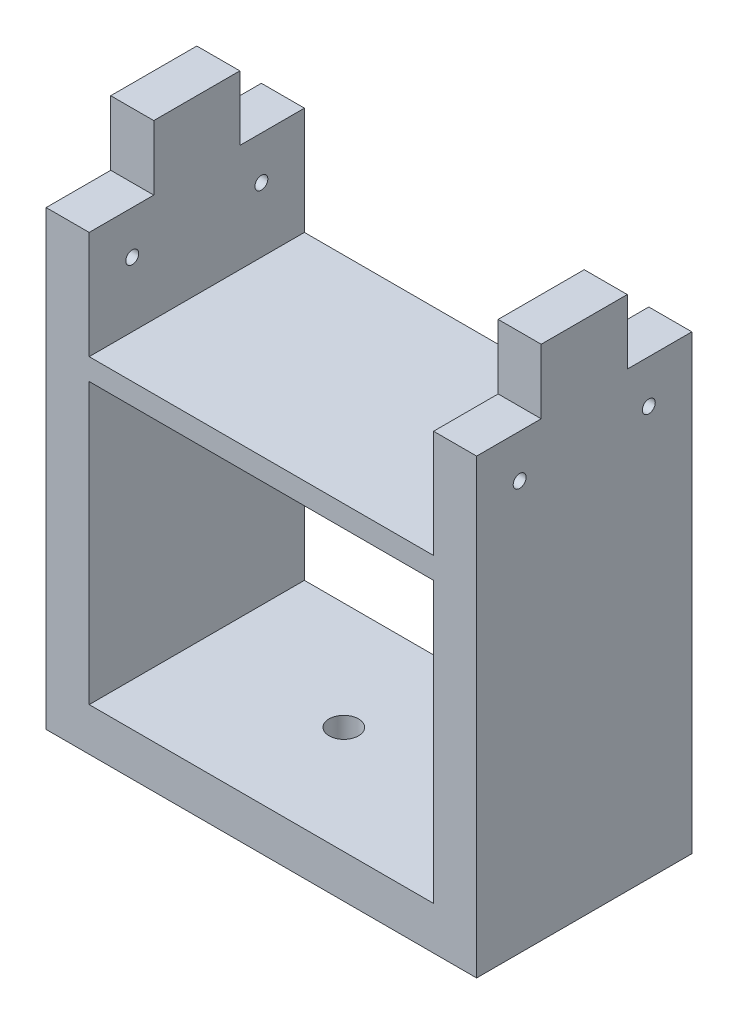
ISO-10303-21;
HEADER;
FILE_DESCRIPTION(('STEP AP214'),'2;1');
FILE_NAME('part.step','',(''),(''),'','','');
FILE_SCHEMA(('AUTOMOTIVE_DESIGN { 1 0 10303 214 1 1 1 1 }'));
ENDSEC;
DATA;
#1=APPLICATION_CONTEXT('core data for automotive mechanical design processes');
#2=APPLICATION_PROTOCOL_DEFINITION('international standard','automotive_design',2000,#1);
#3=PRODUCT_CONTEXT('',#1,'mechanical');
#4=PRODUCT('Part','Part','',(#3));
#5=PRODUCT_RELATED_PRODUCT_CATEGORY('part','',(#4));
#6=PRODUCT_DEFINITION_FORMATION('','',#4);
#7=PRODUCT_DEFINITION_CONTEXT('part definition',#1,'design');
#8=PRODUCT_DEFINITION('design','',#6,#7);
#9=PRODUCT_DEFINITION_SHAPE('','',#8);
#10=(LENGTH_UNIT() NAMED_UNIT(*) SI_UNIT(.MILLI.,.METRE.));
#11=(NAMED_UNIT(*) PLANE_ANGLE_UNIT() SI_UNIT($,.RADIAN.));
#12=(NAMED_UNIT(*) SI_UNIT($,.STERADIAN.) SOLID_ANGLE_UNIT());
#13=UNCERTAINTY_MEASURE_WITH_UNIT(LENGTH_MEASURE(1.E-05),#10,'distance_accuracy_value','');
#14=(GEOMETRIC_REPRESENTATION_CONTEXT(3) GLOBAL_UNCERTAINTY_ASSIGNED_CONTEXT((#13)) GLOBAL_UNIT_ASSIGNED_CONTEXT((#10,
#11,#12)) REPRESENTATION_CONTEXT('',''));
#15=CARTESIAN_POINT('',(0.,0.,0.));
#16=DIRECTION('',(0.,0.,1.));
#17=DIRECTION('',(1.,0.,0.));
#18=AXIS2_PLACEMENT_3D('',#15,#16,#17);
#19=CARTESIAN_POINT('',(50.0100000000001,105.,0.));
#20=DIRECTION('',(0.,-1.,0.));
#21=DIRECTION('',(1.,0.,0.));
#22=AXIS2_PLACEMENT_3D('',#19,#20,#21);
#23=PLANE('',#22);
#24=DIRECTION('',(0.,0.,-1.));
#25=VECTOR('',#24,1.);
#26=CARTESIAN_POINT('',(-40.,105.,50.));
#27=LINE('',#26,#25);
#28=CARTESIAN_POINT('',(-40.,105.,15.));
#29=VERTEX_POINT('',#28);
#30=CARTESIAN_POINT('',(-40.,105.,0.));
#31=VERTEX_POINT('',#30);
#32=EDGE_CURVE('E44',#29,#31,#27,.T.);
#33=ORIENTED_EDGE('',*,*,#32,.T.);
#34=DIRECTION('',(1.,0.,0.));
#35=VECTOR('',#34,1.);
#36=CARTESIAN_POINT('',(0.,105.,0.));
#37=LINE('',#36,#35);
#38=CARTESIAN_POINT('',(-50.,105.,0.));
#39=VERTEX_POINT('',#38);
#40=EDGE_CURVE('E299',#39,#31,#37,.T.);
#41=ORIENTED_EDGE('',*,*,#40,.F.);
#42=DIRECTION('',(0.,0.,-1.));
#43=VECTOR('',#42,1.);
#44=CARTESIAN_POINT('',(-50.,105.,50.));
#45=LINE('',#44,#43);
#46=CARTESIAN_POINT('',(-50.,105.,15.));
#47=VERTEX_POINT('',#46);
#48=EDGE_CURVE('E295',#47,#39,#45,.T.);
#49=ORIENTED_EDGE('',*,*,#48,.F.);
#50=DIRECTION('',(-1.,0.,0.));
#51=VECTOR('',#50,1.);
#52=CARTESIAN_POINT('',(50.0100000000001,105.,15.));
#53=LINE('',#52,#51);
#54=EDGE_CURVE('E312',#29,#47,#53,.T.);
#55=ORIENTED_EDGE('',*,*,#54,.F.);
#56=EDGE_LOOP('',(#33,#41,#49,#55));
#57=FACE_BOUND('',#56,.T.);
#58=ADVANCED_FACE('F41',(#57),#23,.F.);
#59=CARTESIAN_POINT('',(50.0100000000001,105.,15.));
#60=DIRECTION('',(0.,0.,1.));
#61=DIRECTION('',(1.,0.,0.));
#62=AXIS2_PLACEMENT_3D('',#59,#60,#61);
#63=PLANE('',#62);
#64=DIRECTION('',(0.,-1.,0.));
#65=VECTOR('',#64,1.);
#66=CARTESIAN_POINT('',(-40.,216.619003688227,15.));
#67=LINE('',#66,#65);
#68=CARTESIAN_POINT('',(-40.,120.,15.));
#69=VERTEX_POINT('',#68);
#70=EDGE_CURVE('E335',#69,#29,#67,.T.);
#71=ORIENTED_EDGE('',*,*,#70,.T.);
#72=ORIENTED_EDGE('',*,*,#54,.T.);
#73=DIRECTION('',(0.,-1.,0.));
#74=VECTOR('',#73,1.);
#75=CARTESIAN_POINT('',(-50.,225.01,15.));
#76=LINE('',#75,#74);
#77=CARTESIAN_POINT('',(-50.,120.,15.));
#78=VERTEX_POINT('',#77);
#79=EDGE_CURVE('E292',#78,#47,#76,.T.);
#80=ORIENTED_EDGE('',*,*,#79,.F.);
#81=DIRECTION('',(-1.,0.,0.));
#82=VECTOR('',#81,1.);
#83=CARTESIAN_POINT('',(50.0100000000001,120.,15.));
#84=LINE('',#83,#82);
#85=EDGE_CURVE('E308',#69,#78,#84,.T.);
#86=ORIENTED_EDGE('',*,*,#85,.F.);
#87=EDGE_LOOP('',(#71,#72,#80,#86));
#88=FACE_BOUND('',#87,.T.);
#89=ADVANCED_FACE('F394',(#88),#63,.F.);
#90=CARTESIAN_POINT('',(50.0100000000001,120.,15.));
#91=DIRECTION('',(0.,-1.,0.));
#92=DIRECTION('',(1.,0.,0.));
#93=AXIS2_PLACEMENT_3D('',#90,#91,#92);
#94=PLANE('',#93);
#95=DIRECTION('',(0.,0.,-1.));
#96=VECTOR('',#95,1.);
#97=CARTESIAN_POINT('',(-40.,120.,50.));
#98=LINE('',#97,#96);
#99=CARTESIAN_POINT('',(-40.,120.,35.));
#100=VERTEX_POINT('',#99);
#101=EDGE_CURVE('E329',#100,#69,#98,.T.);
#102=ORIENTED_EDGE('',*,*,#101,.T.);
#103=ORIENTED_EDGE('',*,*,#85,.T.);
#104=DIRECTION('',(0.,0.,-1.));
#105=VECTOR('',#104,1.);
#106=CARTESIAN_POINT('',(-50.,120.,50.));
#107=LINE('',#106,#105);
#108=CARTESIAN_POINT('',(-50.,120.,35.));
#109=VERTEX_POINT('',#108);
#110=EDGE_CURVE('E289',#109,#78,#107,.T.);
#111=ORIENTED_EDGE('',*,*,#110,.F.);
#112=DIRECTION('',(-1.,0.,0.));
#113=VECTOR('',#112,1.);
#114=CARTESIAN_POINT('',(50.0100000000001,120.,35.));
#115=LINE('',#114,#113);
#116=EDGE_CURVE('E304',#100,#109,#115,.T.);
#117=ORIENTED_EDGE('',*,*,#116,.F.);
#118=EDGE_LOOP('',(#102,#103,#111,#117));
#119=FACE_BOUND('',#118,.T.);
#120=ADVANCED_FACE('F416',(#119),#94,.F.);
#121=CARTESIAN_POINT('',(50.0100000000001,120.,35.));
#122=DIRECTION('',(0.,0.,-1.));
#123=DIRECTION('',(-1.,0.,0.));
#124=AXIS2_PLACEMENT_3D('',#121,#122,#123);
#125=PLANE('',#124);
#126=DIRECTION('',(0.,1.,0.));
#127=VECTOR('',#126,1.);
#128=CARTESIAN_POINT('',(-40.,216.619003688227,35.));
#129=LINE('',#128,#127);
#130=CARTESIAN_POINT('',(-40.,105.,35.));
#131=VERTEX_POINT('',#130);
#132=EDGE_CURVE('E323',#131,#100,#129,.T.);
#133=ORIENTED_EDGE('',*,*,#132,.T.);
#134=ORIENTED_EDGE('',*,*,#116,.T.);
#135=DIRECTION('',(0.,1.,0.));
#136=VECTOR('',#135,1.);
#137=CARTESIAN_POINT('',(-50.,225.01,35.));
#138=LINE('',#137,#136);
#139=CARTESIAN_POINT('',(-50.,105.,35.));
#140=VERTEX_POINT('',#139);
#141=EDGE_CURVE('E286',#140,#109,#138,.T.);
#142=ORIENTED_EDGE('',*,*,#141,.F.);
#143=DIRECTION('',(-1.,0.,0.));
#144=VECTOR('',#143,1.);
#145=CARTESIAN_POINT('',(50.0100000000001,105.,35.));
#146=LINE('',#145,#144);
#147=EDGE_CURVE('E11',#131,#140,#146,.T.);
#148=ORIENTED_EDGE('',*,*,#147,.F.);
#149=EDGE_LOOP('',(#133,#134,#142,#148));
#150=FACE_BOUND('',#149,.T.);
#151=ADVANCED_FACE('F413',(#150),#125,.F.);
#152=CARTESIAN_POINT('',(50.0100000000001,105.,35.));
#153=DIRECTION('',(0.,-1.,0.));
#154=DIRECTION('',(1.,0.,0.));
#155=AXIS2_PLACEMENT_3D('',#152,#153,#154);
#156=PLANE('',#155);
#157=DIRECTION('',(0.,0.,-1.));
#158=VECTOR('',#157,1.);
#159=CARTESIAN_POINT('',(-40.,105.,50.));
#160=LINE('',#159,#158);
#161=CARTESIAN_POINT('',(-40.,105.,50.));
#162=VERTEX_POINT('',#161);
#163=EDGE_CURVE('E319',#162,#131,#160,.T.);
#164=ORIENTED_EDGE('',*,*,#163,.T.);
#165=ORIENTED_EDGE('',*,*,#147,.T.);
#166=DIRECTION('',(0.,0.,-1.));
#167=VECTOR('',#166,1.);
#168=CARTESIAN_POINT('',(-50.,105.,50.));
#169=LINE('',#168,#167);
#170=CARTESIAN_POINT('',(-50.,105.,50.));
#171=VERTEX_POINT('',#170);
#172=EDGE_CURVE('E283',#171,#140,#169,.T.);
#173=ORIENTED_EDGE('',*,*,#172,.F.);
#174=DIRECTION('',(1.,0.,0.));
#175=VECTOR('',#174,1.);
#176=CARTESIAN_POINT('',(0.,105.,50.));
#177=LINE('',#176,#175);
#178=EDGE_CURVE('E302',#171,#162,#177,.T.);
#179=ORIENTED_EDGE('',*,*,#178,.T.);
#180=EDGE_LOOP('',(#164,#165,#173,#179));
#181=FACE_BOUND('',#180,.T.);
#182=ADVANCED_FACE('F410',(#181),#156,.F.);
#183=DIRECTION('',(0.,0.,1.));
#184=VECTOR('',#183,1.);
#185=CARTESIAN_POINT('',(40.,105.,50.));
#186=LINE('',#185,#184);
#187=CARTESIAN_POINT('',(40.,105.,35.));
#188=VERTEX_POINT('',#187);
#189=CARTESIAN_POINT('',(40.,105.,50.));
#190=VERTEX_POINT('',#189);
#191=EDGE_CURVE('E315',#188,#190,#186,.T.);
#192=ORIENTED_EDGE('',*,*,#191,.T.);
#193=CARTESIAN_POINT('',(50.,105.,50.));
#194=VERTEX_POINT('',#193);
#195=EDGE_CURVE('E300',#190,#194,#177,.T.);
#196=ORIENTED_EDGE('',*,*,#195,.T.);
#197=DIRECTION('',(0.,0.,1.));
#198=VECTOR('',#197,1.);
#199=CARTESIAN_POINT('',(50.,105.,50.));
#200=LINE('',#199,#198);
#201=CARTESIAN_POINT('',(50.,105.,35.));
#202=VERTEX_POINT('',#201);
#203=EDGE_CURVE('E57',#202,#194,#200,.T.);
#204=ORIENTED_EDGE('',*,*,#203,.F.);
#205=EDGE_CURVE('E49',#202,#188,#146,.T.);
#206=ORIENTED_EDGE('',*,*,#205,.T.);
#207=EDGE_LOOP('',(#192,#196,#204,#206));
#208=FACE_BOUND('',#207,.T.);
#209=ADVANCED_FACE('F423',(#208),#156,.F.);
#210=DIRECTION('',(0.,-1.,0.));
#211=VECTOR('',#210,1.);
#212=CARTESIAN_POINT('',(40.,10.,35.));
#213=LINE('',#212,#211);
#214=CARTESIAN_POINT('',(40.,120.,35.));
#215=VERTEX_POINT('',#214);
#216=EDGE_CURVE('E318',#215,#188,#213,.T.);
#217=ORIENTED_EDGE('',*,*,#216,.T.);
#218=ORIENTED_EDGE('',*,*,#205,.F.);
#219=DIRECTION('',(0.,-1.,0.));
#220=VECTOR('',#219,1.);
#221=CARTESIAN_POINT('',(50.,0.,35.));
#222=LINE('',#221,#220);
#223=CARTESIAN_POINT('',(50.,120.,35.));
#224=VERTEX_POINT('',#223);
#225=EDGE_CURVE('E64',#224,#202,#222,.T.);
#226=ORIENTED_EDGE('',*,*,#225,.F.);
#227=EDGE_CURVE('E307',#224,#215,#115,.T.);
#228=ORIENTED_EDGE('',*,*,#227,.T.);
#229=EDGE_LOOP('',(#217,#218,#226,#228));
#230=FACE_BOUND('',#229,.T.);
#231=ADVANCED_FACE('F424',(#230),#125,.F.);
#232=DIRECTION('',(0.,0.,1.));
#233=VECTOR('',#232,1.);
#234=CARTESIAN_POINT('',(40.,120.,50.));
#235=LINE('',#234,#233);
#236=CARTESIAN_POINT('',(40.,120.,15.));
#237=VERTEX_POINT('',#236);
#238=EDGE_CURVE('E326',#237,#215,#235,.T.);
#239=ORIENTED_EDGE('',*,*,#238,.T.);
#240=ORIENTED_EDGE('',*,*,#227,.F.);
#241=DIRECTION('',(0.,0.,1.));
#242=VECTOR('',#241,1.);
#243=CARTESIAN_POINT('',(50.,120.,50.));
#244=LINE('',#243,#242);
#245=CARTESIAN_POINT('',(50.,120.,15.));
#246=VERTEX_POINT('',#245);
#247=EDGE_CURVE('E275',#246,#224,#244,.T.);
#248=ORIENTED_EDGE('',*,*,#247,.F.);
#249=EDGE_CURVE('E311',#246,#237,#84,.T.);
#250=ORIENTED_EDGE('',*,*,#249,.T.);
#251=EDGE_LOOP('',(#239,#240,#248,#250));
#252=FACE_BOUND('',#251,.T.);
#253=ADVANCED_FACE('F428',(#252),#94,.F.);
#254=DIRECTION('',(0.,1.,0.));
#255=VECTOR('',#254,1.);
#256=CARTESIAN_POINT('',(40.,10.,15.));
#257=LINE('',#256,#255);
#258=CARTESIAN_POINT('',(40.,105.,15.));
#259=VERTEX_POINT('',#258);
#260=EDGE_CURVE('E332',#259,#237,#257,.T.);
#261=ORIENTED_EDGE('',*,*,#260,.T.);
#262=ORIENTED_EDGE('',*,*,#249,.F.);
#263=DIRECTION('',(0.,1.,0.));
#264=VECTOR('',#263,1.);
#265=CARTESIAN_POINT('',(50.,0.,15.));
#266=LINE('',#265,#264);
#267=CARTESIAN_POINT('',(50.,105.,15.));
#268=VERTEX_POINT('',#267);
#269=EDGE_CURVE('E277',#268,#246,#266,.T.);
#270=ORIENTED_EDGE('',*,*,#269,.F.);
#271=EDGE_CURVE('E301',#268,#259,#53,.T.);
#272=ORIENTED_EDGE('',*,*,#271,.T.);
#273=EDGE_LOOP('',(#261,#262,#270,#272));
#274=FACE_BOUND('',#273,.T.);
#275=ADVANCED_FACE('F431',(#274),#63,.F.);
#276=DIRECTION('',(0.,0.,1.));
#277=VECTOR('',#276,1.);
#278=CARTESIAN_POINT('',(40.,105.,50.));
#279=LINE('',#278,#277);
#280=CARTESIAN_POINT('',(40.,105.,0.));
#281=VERTEX_POINT('',#280);
#282=EDGE_CURVE('E322',#281,#259,#279,.T.);
#283=ORIENTED_EDGE('',*,*,#282,.T.);
#284=ORIENTED_EDGE('',*,*,#271,.F.);
#285=DIRECTION('',(0.,0.,1.));
#286=VECTOR('',#285,1.);
#287=CARTESIAN_POINT('',(50.,105.,50.));
#288=LINE('',#287,#286);
#289=CARTESIAN_POINT('',(50.,105.,0.));
#290=VERTEX_POINT('',#289);
#291=EDGE_CURVE('E280',#290,#268,#288,.T.);
#292=ORIENTED_EDGE('',*,*,#291,.F.);
#293=EDGE_CURVE('E297',#281,#290,#37,.T.);
#294=ORIENTED_EDGE('',*,*,#293,.F.);
#295=EDGE_LOOP('',(#283,#284,#292,#294));
#296=FACE_BOUND('',#295,.T.);
#297=ADVANCED_FACE('F343',(#296),#23,.F.);
#298=CARTESIAN_POINT('',(24.130974017595,0.,25.));
#299=DIRECTION('',(0.,1.,0.));
#300=DIRECTION('',(-1.,0.,0.));
#301=AXIS2_PLACEMENT_3D('',#298,#299,#300);
#302=CYLINDRICAL_SURFACE('',#301,3.425);
#303=CARTESIAN_POINT('',(24.130974017595,0.,25.));
#304=DIRECTION('',(0.,1.,0.));
#305=DIRECTION('',(-1.,0.,0.));
#306=AXIS2_PLACEMENT_3D('',#303,#304,#305);
#307=CIRCLE('',#306,3.425);
#308=CARTESIAN_POINT('',(20.705974017595,0.,25.));
#309=VERTEX_POINT('',#308);
#310=EDGE_CURVE('E221',#309,#309,#307,.T.);
#311=ORIENTED_EDGE('',*,*,#310,.F.);
#312=EDGE_LOOP('',(#311));
#313=FACE_BOUND('',#312,.T.);
#314=CARTESIAN_POINT('',(24.130974017595,10.,25.));
#315=DIRECTION('',(0.,1.,0.));
#316=DIRECTION('',(-1.,0.,0.));
#317=AXIS2_PLACEMENT_3D('',#314,#315,#316);
#318=CIRCLE('',#317,3.425);
#319=CARTESIAN_POINT('',(20.705974017595,10.,25.));
#320=VERTEX_POINT('',#319);
#321=EDGE_CURVE('E232',#320,#320,#318,.T.);
#322=ORIENTED_EDGE('',*,*,#321,.T.);
#323=EDGE_LOOP('',(#322));
#324=FACE_BOUND('',#323,.T.);
#325=ADVANCED_FACE('F455',(#313,#324),#302,.F.);
#326=CARTESIAN_POINT('',(-5.85128713251137,0.,25.));
#327=DIRECTION('',(0.,1.,0.));
#328=DIRECTION('',(-1.,0.,0.));
#329=AXIS2_PLACEMENT_3D('',#326,#327,#328);
#330=CYLINDRICAL_SURFACE('',#329,3.425);
#331=CARTESIAN_POINT('',(-5.85128713251137,0.,25.));
#332=DIRECTION('',(0.,1.,0.));
#333=DIRECTION('',(-1.,0.,0.));
#334=AXIS2_PLACEMENT_3D('',#331,#332,#333);
#335=CIRCLE('',#334,3.425);
#336=CARTESIAN_POINT('',(-9.27628713251137,0.,25.));
#337=VERTEX_POINT('',#336);
#338=EDGE_CURVE('E226',#337,#337,#335,.T.);
#339=ORIENTED_EDGE('',*,*,#338,.F.);
#340=EDGE_LOOP('',(#339));
#341=FACE_BOUND('',#340,.T.);
#342=CARTESIAN_POINT('',(-5.85128713251138,10.,25.));
#343=DIRECTION('',(0.,1.,0.));
#344=DIRECTION('',(-1.,0.,0.));
#345=AXIS2_PLACEMENT_3D('',#342,#343,#344);
#346=CIRCLE('',#345,3.425);
#347=CARTESIAN_POINT('',(-9.27628713251138,10.,25.));
#348=VERTEX_POINT('',#347);
#349=EDGE_CURVE('E229',#348,#348,#346,.T.);
#350=ORIENTED_EDGE('',*,*,#349,.T.);
#351=EDGE_LOOP('',(#350));
#352=FACE_BOUND('',#351,.T.);
#353=ADVANCED_FACE('F460',(#341,#352),#330,.F.);
#354=CARTESIAN_POINT('',(40.,10.,50.));
#355=DIRECTION('',(-1.,0.,0.));
#356=DIRECTION('',(0.,0.,1.));
#357=AXIS2_PLACEMENT_3D('',#354,#355,#356);
#358=PLANE('',#357);
#359=ORIENTED_EDGE('',*,*,#282,.F.);
#360=DIRECTION('',(0.,1.,0.));
#361=VECTOR('',#360,1.);
#362=CARTESIAN_POINT('',(40.,10.,0.));
#363=LINE('',#362,#361);
#364=CARTESIAN_POINT('',(40.,80.,0.));
#365=VERTEX_POINT('',#364);
#366=EDGE_CURVE('E247',#365,#281,#363,.T.);
#367=ORIENTED_EDGE('',*,*,#366,.F.);
#368=DIRECTION('',(0.,0.,1.));
#369=VECTOR('',#368,1.);
#370=CARTESIAN_POINT('',(40.,80.,0.));
#371=LINE('',#370,#369);
#372=CARTESIAN_POINT('',(40.,80.,50.));
#373=VERTEX_POINT('',#372);
#374=EDGE_CURVE('E222',#365,#373,#371,.T.);
#375=ORIENTED_EDGE('',*,*,#374,.T.);
#376=DIRECTION('',(0.,1.,0.));
#377=VECTOR('',#376,1.);
#378=CARTESIAN_POINT('',(40.,10.,50.));
#379=LINE('',#378,#377);
#380=EDGE_CURVE('E238',#373,#190,#379,.T.);
#381=ORIENTED_EDGE('',*,*,#380,.T.);
#382=ORIENTED_EDGE('',*,*,#191,.F.);
#383=ORIENTED_EDGE('',*,*,#216,.F.);
#384=ORIENTED_EDGE('',*,*,#238,.F.);
#385=ORIENTED_EDGE('',*,*,#260,.F.);
#386=EDGE_LOOP('',(#359,#367,#375,#381,#382,#383,#384,#385));
#387=FACE_BOUND('',#386,.T.);
#388=CARTESIAN_POINT('',(40.,95.,9.99999999999999));
#389=DIRECTION('',(-1.,0.,0.));
#390=DIRECTION('',(0.,0.,1.));
#391=AXIS2_PLACEMENT_3D('',#388,#389,#390);
#392=CIRCLE('',#391,1.5);
#393=CARTESIAN_POINT('',(40.,95.,11.5));
#394=VERTEX_POINT('',#393);
#395=EDGE_CURVE('E213',#394,#394,#392,.T.);
#396=ORIENTED_EDGE('',*,*,#395,.F.);
#397=EDGE_LOOP('',(#396));
#398=FACE_BOUND('',#397,.T.);
#399=CARTESIAN_POINT('',(40.,95.,40.));
#400=DIRECTION('',(-1.,0.,0.));
#401=DIRECTION('',(0.,0.,1.));
#402=AXIS2_PLACEMENT_3D('',#399,#400,#401);
#403=CIRCLE('',#402,1.5);
#404=CARTESIAN_POINT('',(40.,95.,41.5));
#405=VERTEX_POINT('',#404);
#406=EDGE_CURVE('E366',#405,#405,#403,.T.);
#407=ORIENTED_EDGE('',*,*,#406,.F.);
#408=EDGE_LOOP('',(#407));
#409=FACE_BOUND('',#408,.T.);
#410=ADVANCED_FACE('F348',(#387,#398,#409),#358,.T.);
#411=CARTESIAN_POINT('',(40.,80.,0.));
#412=DIRECTION('',(0.,1.,0.));
#413=DIRECTION('',(-1.,0.,0.));
#414=AXIS2_PLACEMENT_3D('',#411,#412,#413);
#415=PLANE('',#414);
#416=DIRECTION('',(-1.,0.,0.));
#417=VECTOR('',#416,1.);
#418=CARTESIAN_POINT('',(40.,80.,50.));
#419=LINE('',#418,#417);
#420=CARTESIAN_POINT('',(-40.,80.,50.));
#421=VERTEX_POINT('',#420);
#422=EDGE_CURVE('E206',#373,#421,#419,.T.);
#423=ORIENTED_EDGE('',*,*,#422,.F.);
#424=ORIENTED_EDGE('',*,*,#374,.F.);
#425=DIRECTION('',(-1.,0.,0.));
#426=VECTOR('',#425,1.);
#427=CARTESIAN_POINT('',(40.,80.,0.));
#428=LINE('',#427,#426);
#429=CARTESIAN_POINT('',(-40.,80.,0.));
#430=VERTEX_POINT('',#429);
#431=EDGE_CURVE('E202',#365,#430,#428,.T.);
#432=ORIENTED_EDGE('',*,*,#431,.T.);
#433=DIRECTION('',(0.,0.,1.));
#434=VECTOR('',#433,1.);
#435=CARTESIAN_POINT('',(-40.,80.,0.));
#436=LINE('',#435,#434);
#437=EDGE_CURVE('E218',#430,#421,#436,.T.);
#438=ORIENTED_EDGE('',*,*,#437,.T.);
#439=EDGE_LOOP('',(#423,#424,#432,#438));
#440=FACE_BOUND('',#439,.T.);
#441=ADVANCED_FACE('F421',(#440),#415,.T.);
#442=CARTESIAN_POINT('',(-40.,216.619003688227,50.));
#443=DIRECTION('',(1.,0.,0.));
#444=DIRECTION('',(0.,1.,0.));
#445=AXIS2_PLACEMENT_3D('',#442,#443,#444);
#446=PLANE('',#445);
#447=ORIENTED_EDGE('',*,*,#32,.F.);
#448=ORIENTED_EDGE('',*,*,#70,.F.);
#449=ORIENTED_EDGE('',*,*,#101,.F.);
#450=ORIENTED_EDGE('',*,*,#132,.F.);
#451=ORIENTED_EDGE('',*,*,#163,.F.);
#452=DIRECTION('',(0.,-1.,0.));
#453=VECTOR('',#452,1.);
#454=CARTESIAN_POINT('',(-40.,216.619003688227,50.));
#455=LINE('',#454,#453);
#456=EDGE_CURVE('E191',#162,#421,#455,.T.);
#457=ORIENTED_EDGE('',*,*,#456,.T.);
#458=ORIENTED_EDGE('',*,*,#437,.F.);
#459=DIRECTION('',(0.,-1.,0.));
#460=VECTOR('',#459,1.);
#461=CARTESIAN_POINT('',(-40.,216.619003688227,0.));
#462=LINE('',#461,#460);
#463=EDGE_CURVE('E242',#31,#430,#462,.T.);
#464=ORIENTED_EDGE('',*,*,#463,.F.);
#465=EDGE_LOOP('',(#447,#448,#449,#450,#451,#457,#458,#464));
#466=FACE_BOUND('',#465,.T.);
#467=CARTESIAN_POINT('',(-40.,95.,9.99999999999999));
#468=DIRECTION('',(1.,0.,0.));
#469=DIRECTION('',(0.,1.,0.));
#470=AXIS2_PLACEMENT_3D('',#467,#468,#469);
#471=CIRCLE('',#470,1.5);
#472=CARTESIAN_POINT('',(-40.,96.5,9.99999999999999));
#473=VERTEX_POINT('',#472);
#474=EDGE_CURVE('E207',#473,#473,#471,.T.);
#475=ORIENTED_EDGE('',*,*,#474,.F.);
#476=EDGE_LOOP('',(#475));
#477=FACE_BOUND('',#476,.T.);
#478=CARTESIAN_POINT('',(-40.,95.,40.));
#479=DIRECTION('',(1.,0.,0.));
#480=DIRECTION('',(0.,1.,0.));
#481=AXIS2_PLACEMENT_3D('',#478,#479,#480);
#482=CIRCLE('',#481,1.5);
#483=CARTESIAN_POINT('',(-40.,96.5,40.));
#484=VERTEX_POINT('',#483);
#485=EDGE_CURVE('E363',#484,#484,#482,.T.);
#486=ORIENTED_EDGE('',*,*,#485,.F.);
#487=EDGE_LOOP('',(#486));
#488=FACE_BOUND('',#487,.T.);
#489=ADVANCED_FACE('F418',(#466,#477,#488),#446,.T.);
#490=DIRECTION('',(0.,0.,1.));
#491=VECTOR('',#490,1.);
#492=CARTESIAN_POINT('',(40.,75.,0.));
#493=LINE('',#492,#491);
#494=CARTESIAN_POINT('',(40.,75.,0.));
#495=VERTEX_POINT('',#494);
#496=CARTESIAN_POINT('',(40.,75.,50.));
#497=VERTEX_POINT('',#496);
#498=EDGE_CURVE('E201',#495,#497,#493,.T.);
#499=ORIENTED_EDGE('',*,*,#498,.F.);
#500=CARTESIAN_POINT('',(40.,10.,0.));
#501=VERTEX_POINT('',#500);
#502=EDGE_CURVE('E192',#501,#495,#363,.T.);
#503=ORIENTED_EDGE('',*,*,#502,.F.);
#504=DIRECTION('',(0.,0.,-1.));
#505=VECTOR('',#504,1.);
#506=CARTESIAN_POINT('',(40.,10.,50.));
#507=LINE('',#506,#505);
#508=CARTESIAN_POINT('',(40.,10.,50.));
#509=VERTEX_POINT('',#508);
#510=EDGE_CURVE('E241',#509,#501,#507,.T.);
#511=ORIENTED_EDGE('',*,*,#510,.F.);
#512=EDGE_CURVE('E239',#509,#497,#379,.T.);
#513=ORIENTED_EDGE('',*,*,#512,.T.);
#514=EDGE_LOOP('',(#499,#503,#511,#513));
#515=FACE_BOUND('',#514,.T.);
#516=ADVANCED_FACE('F489',(#515),#358,.T.);
#517=CARTESIAN_POINT('',(-40.,10.,50.));
#518=DIRECTION('',(0.,1.,0.));
#519=DIRECTION('',(-1.,0.,0.));
#520=AXIS2_PLACEMENT_3D('',#517,#518,#519);
#521=PLANE('',#520);
#522=ORIENTED_EDGE('',*,*,#349,.F.);
#523=EDGE_LOOP('',(#522));
#524=FACE_BOUND('',#523,.T.);
#525=ORIENTED_EDGE('',*,*,#321,.F.);
#526=EDGE_LOOP('',(#525));
#527=FACE_BOUND('',#526,.T.);
#528=DIRECTION('',(1.,0.,0.));
#529=VECTOR('',#528,1.);
#530=CARTESIAN_POINT('',(-40.,10.,0.));
#531=LINE('',#530,#529);
#532=CARTESIAN_POINT('',(-40.,10.,0.));
#533=VERTEX_POINT('',#532);
#534=EDGE_CURVE('E244',#533,#501,#531,.T.);
#535=ORIENTED_EDGE('',*,*,#534,.F.);
#536=DIRECTION('',(0.,0.,-1.));
#537=VECTOR('',#536,1.);
#538=CARTESIAN_POINT('',(-40.,10.,50.));
#539=LINE('',#538,#537);
#540=CARTESIAN_POINT('',(-40.,10.,50.));
#541=VERTEX_POINT('',#540);
#542=EDGE_CURVE('E251',#541,#533,#539,.T.);
#543=ORIENTED_EDGE('',*,*,#542,.F.);
#544=DIRECTION('',(1.,0.,0.));
#545=VECTOR('',#544,1.);
#546=CARTESIAN_POINT('',(-40.,10.,50.));
#547=LINE('',#546,#545);
#548=EDGE_CURVE('E187',#541,#509,#547,.T.);
#549=ORIENTED_EDGE('',*,*,#548,.T.);
#550=ORIENTED_EDGE('',*,*,#510,.T.);
#551=EDGE_LOOP('',(#535,#543,#549,#550));
#552=FACE_BOUND('',#551,.T.);
#553=ADVANCED_FACE('F486',(#524,#527,#552),#521,.T.);
#554=DIRECTION('',(0.,0.,1.));
#555=VECTOR('',#554,1.);
#556=CARTESIAN_POINT('',(-40.,75.,0.));
#557=LINE('',#556,#555);
#558=CARTESIAN_POINT('',(-40.,75.,0.));
#559=VERTEX_POINT('',#558);
#560=CARTESIAN_POINT('',(-40.,75.,50.));
#561=VERTEX_POINT('',#560);
#562=EDGE_CURVE('E195',#559,#561,#557,.T.);
#563=ORIENTED_EDGE('',*,*,#562,.T.);
#564=EDGE_CURVE('E181',#561,#541,#455,.T.);
#565=ORIENTED_EDGE('',*,*,#564,.T.);
#566=ORIENTED_EDGE('',*,*,#542,.T.);
#567=EDGE_CURVE('E197',#559,#533,#462,.T.);
#568=ORIENTED_EDGE('',*,*,#567,.F.);
#569=EDGE_LOOP('',(#563,#565,#566,#568));
#570=FACE_BOUND('',#569,.T.);
#571=ADVANCED_FACE('F196',(#570),#446,.T.);
#572=CARTESIAN_POINT('',(-40.,75.,0.));
#573=DIRECTION('',(0.,-1.,0.));
#574=DIRECTION('',(0.,0.,-1.));
#575=AXIS2_PLACEMENT_3D('',#572,#573,#574);
#576=PLANE('',#575);
#577=DIRECTION('',(1.,0.,0.));
#578=VECTOR('',#577,1.);
#579=CARTESIAN_POINT('',(-40.,75.,50.));
#580=LINE('',#579,#578);
#581=EDGE_CURVE('E186',#561,#497,#580,.T.);
#582=ORIENTED_EDGE('',*,*,#581,.F.);
#583=ORIENTED_EDGE('',*,*,#562,.F.);
#584=DIRECTION('',(1.,0.,0.));
#585=VECTOR('',#584,1.);
#586=CARTESIAN_POINT('',(-40.,75.,0.));
#587=LINE('',#586,#585);
#588=EDGE_CURVE('E210',#559,#495,#587,.T.);
#589=ORIENTED_EDGE('',*,*,#588,.T.);
#590=ORIENTED_EDGE('',*,*,#498,.T.);
#591=EDGE_LOOP('',(#582,#583,#589,#590));
#592=FACE_BOUND('',#591,.T.);
#593=ADVANCED_FACE('F205',(#592),#576,.T.);
#594=CARTESIAN_POINT('',(-50.,0.,50.));
#595=DIRECTION('',(0.,1.,0.));
#596=DIRECTION('',(0.,0.,1.));
#597=AXIS2_PLACEMENT_3D('',#594,#595,#596);
#598=PLANE('',#597);
#599=ORIENTED_EDGE('',*,*,#338,.T.);
#600=EDGE_LOOP('',(#599));
#601=FACE_BOUND('',#600,.T.);
#602=ORIENTED_EDGE('',*,*,#310,.T.);
#603=EDGE_LOOP('',(#602));
#604=FACE_BOUND('',#603,.T.);
#605=DIRECTION('',(1.,0.,0.));
#606=VECTOR('',#605,1.);
#607=CARTESIAN_POINT('',(-50.,0.,0.));
#608=LINE('',#607,#606);
#609=CARTESIAN_POINT('',(-50.,0.,0.));
#610=VERTEX_POINT('',#609);
#611=CARTESIAN_POINT('',(50.,0.,0.));
#612=VERTEX_POINT('',#611);
#613=EDGE_CURVE('E264',#610,#612,#608,.T.);
#614=ORIENTED_EDGE('',*,*,#613,.T.);
#615=DIRECTION('',(0.,0.,-1.));
#616=VECTOR('',#615,1.);
#617=CARTESIAN_POINT('',(50.,0.,50.));
#618=LINE('',#617,#616);
#619=CARTESIAN_POINT('',(50.,0.,50.));
#620=VERTEX_POINT('',#619);
#621=EDGE_CURVE('E262',#620,#612,#618,.T.);
#622=ORIENTED_EDGE('',*,*,#621,.F.);
#623=DIRECTION('',(1.,0.,0.));
#624=VECTOR('',#623,1.);
#625=CARTESIAN_POINT('',(-50.,0.,50.));
#626=LINE('',#625,#624);
#627=CARTESIAN_POINT('',(-50.,0.,50.));
#628=VERTEX_POINT('',#627);
#629=EDGE_CURVE('E256',#628,#620,#626,.T.);
#630=ORIENTED_EDGE('',*,*,#629,.F.);
#631=DIRECTION('',(0.,0.,-1.));
#632=VECTOR('',#631,1.);
#633=CARTESIAN_POINT('',(-50.,0.,50.));
#634=LINE('',#633,#632);
#635=EDGE_CURVE('E270',#628,#610,#634,.T.);
#636=ORIENTED_EDGE('',*,*,#635,.T.);
#637=EDGE_LOOP('',(#614,#622,#630,#636));
#638=FACE_BOUND('',#637,.T.);
#639=ADVANCED_FACE('F402',(#601,#604,#638),#598,.F.);
#640=CARTESIAN_POINT('',(0.,0.,50.));
#641=DIRECTION('',(0.,0.,1.));
#642=DIRECTION('',(1.,0.,0.));
#643=AXIS2_PLACEMENT_3D('',#640,#641,#642);
#644=PLANE('',#643);
#645=ORIENTED_EDGE('',*,*,#178,.F.);
#646=DIRECTION('',(0.,-1.,0.));
#647=VECTOR('',#646,1.);
#648=CARTESIAN_POINT('',(-50.,225.01,50.));
#649=LINE('',#648,#647);
#650=EDGE_CURVE('E254',#171,#628,#649,.T.);
#651=ORIENTED_EDGE('',*,*,#650,.T.);
#652=ORIENTED_EDGE('',*,*,#629,.T.);
#653=DIRECTION('',(0.,1.,0.));
#654=VECTOR('',#653,1.);
#655=CARTESIAN_POINT('',(50.,0.,50.));
#656=LINE('',#655,#654);
#657=EDGE_CURVE('E259',#620,#194,#656,.T.);
#658=ORIENTED_EDGE('',*,*,#657,.T.);
#659=ORIENTED_EDGE('',*,*,#195,.F.);
#660=ORIENTED_EDGE('',*,*,#380,.F.);
#661=ORIENTED_EDGE('',*,*,#422,.T.);
#662=ORIENTED_EDGE('',*,*,#456,.F.);
#663=EDGE_LOOP('',(#645,#651,#652,#658,#659,#660,#661,#662));
#664=FACE_BOUND('',#663,.T.);
#665=ORIENTED_EDGE('',*,*,#564,.F.);
#666=ORIENTED_EDGE('',*,*,#581,.T.);
#667=ORIENTED_EDGE('',*,*,#512,.F.);
#668=ORIENTED_EDGE('',*,*,#548,.F.);
#669=EDGE_LOOP('',(#665,#666,#667,#668));
#670=FACE_BOUND('',#669,.T.);
#671=ADVANCED_FACE('F183',(#664,#670),#644,.T.);
#672=CARTESIAN_POINT('',(0.,0.,0.));
#673=DIRECTION('',(0.,0.,1.));
#674=DIRECTION('',(1.,0.,0.));
#675=AXIS2_PLACEMENT_3D('',#672,#673,#674);
#676=PLANE('',#675);
#677=ORIENTED_EDGE('',*,*,#588,.F.);
#678=ORIENTED_EDGE('',*,*,#567,.T.);
#679=ORIENTED_EDGE('',*,*,#534,.T.);
#680=ORIENTED_EDGE('',*,*,#502,.T.);
#681=EDGE_LOOP('',(#677,#678,#679,#680));
#682=FACE_BOUND('',#681,.T.);
#683=DIRECTION('',(0.,-1.,0.));
#684=VECTOR('',#683,1.);
#685=CARTESIAN_POINT('',(-50.,225.01,0.));
#686=LINE('',#685,#684);
#687=EDGE_CURVE('E253',#39,#610,#686,.T.);
#688=ORIENTED_EDGE('',*,*,#687,.F.);
#689=ORIENTED_EDGE('',*,*,#40,.T.);
#690=ORIENTED_EDGE('',*,*,#463,.T.);
#691=ORIENTED_EDGE('',*,*,#431,.F.);
#692=ORIENTED_EDGE('',*,*,#366,.T.);
#693=ORIENTED_EDGE('',*,*,#293,.T.);
#694=DIRECTION('',(0.,1.,0.));
#695=VECTOR('',#694,1.);
#696=CARTESIAN_POINT('',(50.,0.,0.));
#697=LINE('',#696,#695);
#698=EDGE_CURVE('E257',#612,#290,#697,.T.);
#699=ORIENTED_EDGE('',*,*,#698,.F.);
#700=ORIENTED_EDGE('',*,*,#613,.F.);
#701=EDGE_LOOP('',(#688,#689,#690,#691,#692,#693,#699,#700));
#702=FACE_BOUND('',#701,.T.);
#703=ADVANCED_FACE('F354',(#682,#702),#676,.F.);
#704=CARTESIAN_POINT('',(50.,95.,40.));
#705=DIRECTION('',(-1.,0.,0.));
#706=DIRECTION('',(0.,-1.,0.));
#707=AXIS2_PLACEMENT_3D('',#704,#705,#706);
#708=CYLINDRICAL_SURFACE('',#707,1.5);
#709=ORIENTED_EDGE('',*,*,#406,.T.);
#710=EDGE_LOOP('',(#709));
#711=FACE_BOUND('',#710,.T.);
#712=CARTESIAN_POINT('',(50.,95.,40.));
#713=DIRECTION('',(-1.,0.,0.));
#714=DIRECTION('',(0.,-1.,0.));
#715=AXIS2_PLACEMENT_3D('',#712,#713,#714);
#716=CIRCLE('',#715,1.5);
#717=CARTESIAN_POINT('',(50.,93.5,40.));
#718=VERTEX_POINT('',#717);
#719=EDGE_CURVE('E376',#718,#718,#716,.T.);
#720=ORIENTED_EDGE('',*,*,#719,.F.);
#721=EDGE_LOOP('',(#720));
#722=FACE_BOUND('',#721,.T.);
#723=ADVANCED_FACE('F444',(#711,#722),#708,.F.);
#724=CARTESIAN_POINT('',(50.,95.,9.99999999999999));
#725=DIRECTION('',(-1.,0.,0.));
#726=DIRECTION('',(0.,-1.,0.));
#727=AXIS2_PLACEMENT_3D('',#724,#725,#726);
#728=CYLINDRICAL_SURFACE('',#727,1.5);
#729=ORIENTED_EDGE('',*,*,#395,.T.);
#730=EDGE_LOOP('',(#729));
#731=FACE_BOUND('',#730,.T.);
#732=CARTESIAN_POINT('',(50.,95.,9.99999999999999));
#733=DIRECTION('',(-1.,0.,0.));
#734=DIRECTION('',(0.,1.,0.));
#735=AXIS2_PLACEMENT_3D('',#732,#733,#734);
#736=CIRCLE('',#735,1.5);
#737=CARTESIAN_POINT('',(50.,96.5,9.99999999999999));
#738=VERTEX_POINT('',#737);
#739=EDGE_CURVE('E370',#738,#738,#736,.T.);
#740=ORIENTED_EDGE('',*,*,#739,.F.);
#741=EDGE_LOOP('',(#740));
#742=FACE_BOUND('',#741,.T.);
#743=ADVANCED_FACE('F435',(#731,#742),#728,.F.);
#744=CARTESIAN_POINT('',(50.,0.,50.));
#745=DIRECTION('',(-1.,0.,0.));
#746=DIRECTION('',(0.,-1.,0.));
#747=AXIS2_PLACEMENT_3D('',#744,#745,#746);
#748=PLANE('',#747);
#749=ORIENTED_EDGE('',*,*,#739,.T.);
#750=EDGE_LOOP('',(#749));
#751=FACE_BOUND('',#750,.T.);
#752=ORIENTED_EDGE('',*,*,#719,.T.);
#753=EDGE_LOOP('',(#752));
#754=FACE_BOUND('',#753,.T.);
#755=ORIENTED_EDGE('',*,*,#698,.T.);
#756=ORIENTED_EDGE('',*,*,#291,.T.);
#757=ORIENTED_EDGE('',*,*,#269,.T.);
#758=ORIENTED_EDGE('',*,*,#247,.T.);
#759=ORIENTED_EDGE('',*,*,#225,.T.);
#760=ORIENTED_EDGE('',*,*,#203,.T.);
#761=ORIENTED_EDGE('',*,*,#657,.F.);
#762=ORIENTED_EDGE('',*,*,#621,.T.);
#763=EDGE_LOOP('',(#755,#756,#757,#758,#759,#760,#761,#762));
#764=FACE_BOUND('',#763,.T.);
#765=ADVANCED_FACE('F433',(#751,#754,#764),#748,.F.);
#766=ORIENTED_EDGE('',*,*,#485,.T.);
#767=EDGE_LOOP('',(#766));
#768=FACE_BOUND('',#767,.T.);
#769=CARTESIAN_POINT('',(-50.,95.,40.));
#770=DIRECTION('',(-1.,0.,0.));
#771=DIRECTION('',(0.,-1.,0.));
#772=AXIS2_PLACEMENT_3D('',#769,#770,#771);
#773=CIRCLE('',#772,1.5);
#774=CARTESIAN_POINT('',(-50.,93.5,40.));
#775=VERTEX_POINT('',#774);
#776=EDGE_CURVE('E369',#775,#775,#773,.T.);
#777=ORIENTED_EDGE('',*,*,#776,.T.);
#778=EDGE_LOOP('',(#777));
#779=FACE_BOUND('',#778,.T.);
#780=ADVANCED_FACE('F382',(#768,#779),#708,.F.);
#781=ORIENTED_EDGE('',*,*,#474,.T.);
#782=EDGE_LOOP('',(#781));
#783=FACE_BOUND('',#782,.T.);
#784=CARTESIAN_POINT('',(-50.,95.,9.99999999999999));
#785=DIRECTION('',(-1.,0.,0.));
#786=DIRECTION('',(0.,1.,0.));
#787=AXIS2_PLACEMENT_3D('',#784,#785,#786);
#788=CIRCLE('',#787,1.5);
#789=CARTESIAN_POINT('',(-50.,96.5,9.99999999999999));
#790=VERTEX_POINT('',#789);
#791=EDGE_CURVE('E373',#790,#790,#788,.T.);
#792=ORIENTED_EDGE('',*,*,#791,.T.);
#793=EDGE_LOOP('',(#792));
#794=FACE_BOUND('',#793,.T.);
#795=ADVANCED_FACE('F387',(#783,#794),#728,.F.);
#796=CARTESIAN_POINT('',(-50.,225.01,50.));
#797=DIRECTION('',(1.,0.,0.));
#798=DIRECTION('',(0.,1.,0.));
#799=AXIS2_PLACEMENT_3D('',#796,#797,#798);
#800=PLANE('',#799);
#801=ORIENTED_EDGE('',*,*,#791,.F.);
#802=EDGE_LOOP('',(#801));
#803=FACE_BOUND('',#802,.T.);
#804=ORIENTED_EDGE('',*,*,#776,.F.);
#805=EDGE_LOOP('',(#804));
#806=FACE_BOUND('',#805,.T.);
#807=ORIENTED_EDGE('',*,*,#79,.T.);
#808=ORIENTED_EDGE('',*,*,#48,.T.);
#809=ORIENTED_EDGE('',*,*,#687,.T.);
#810=ORIENTED_EDGE('',*,*,#635,.F.);
#811=ORIENTED_EDGE('',*,*,#650,.F.);
#812=ORIENTED_EDGE('',*,*,#172,.T.);
#813=ORIENTED_EDGE('',*,*,#141,.T.);
#814=ORIENTED_EDGE('',*,*,#110,.T.);
#815=EDGE_LOOP('',(#807,#808,#809,#810,#811,#812,#813,#814));
#816=FACE_BOUND('',#815,.T.);
#817=ADVANCED_FACE('F384',(#803,#806,#816),#800,.F.);
#818=CLOSED_SHELL('',(#58,#89,#120,#151,#182,#209,#231,#253,#275,#297,#325,#353,#410,#441,#489,
#516,#553,#571,#593,#639,#671,#703,#723,#743,#765,#780,#795,#817));
#819=MANIFOLD_SOLID_BREP('B2',#818);
#820=ADVANCED_BREP_SHAPE_REPRESENTATION('',(#18,#819),#14);
#821=SHAPE_DEFINITION_REPRESENTATION(#9,#820);
ENDSEC;
END-ISO-10303-21;
